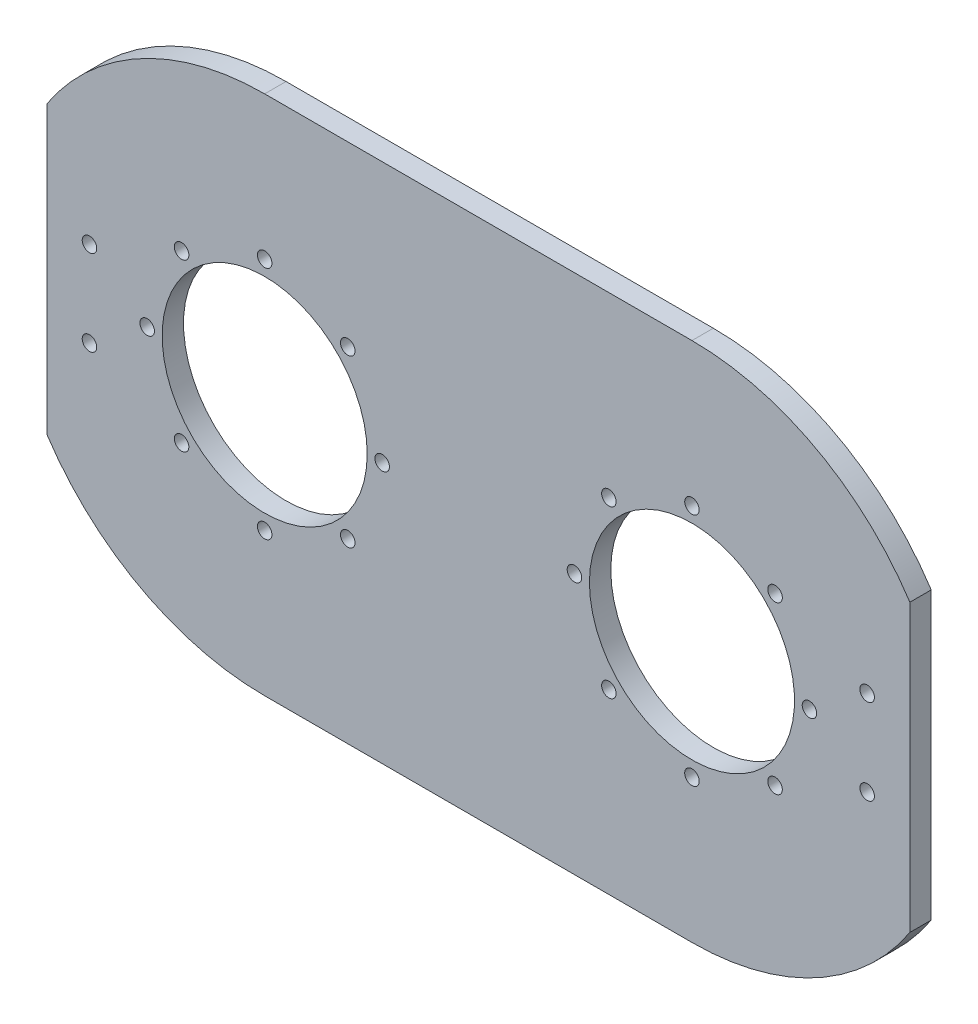
ISO-10303-21;
HEADER;
FILE_DESCRIPTION(('STEP AP214'),'2;1');
FILE_NAME('part.step','',(''),(''),'','','');
FILE_SCHEMA(('AUTOMOTIVE_DESIGN { 1 0 10303 214 1 1 1 1 }'));
ENDSEC;
DATA;
#1=APPLICATION_CONTEXT('core data for automotive mechanical design processes');
#2=APPLICATION_PROTOCOL_DEFINITION('international standard','automotive_design',2000,#1);
#3=PRODUCT_CONTEXT('',#1,'mechanical');
#4=PRODUCT('Part','Part','',(#3));
#5=PRODUCT_RELATED_PRODUCT_CATEGORY('part','',(#4));
#6=PRODUCT_DEFINITION_FORMATION('','',#4);
#7=PRODUCT_DEFINITION_CONTEXT('part definition',#1,'design');
#8=PRODUCT_DEFINITION('design','',#6,#7);
#9=PRODUCT_DEFINITION_SHAPE('','',#8);
#10=(LENGTH_UNIT() NAMED_UNIT(*) SI_UNIT(.MILLI.,.METRE.));
#11=(NAMED_UNIT(*) PLANE_ANGLE_UNIT() SI_UNIT($,.RADIAN.));
#12=(NAMED_UNIT(*) SI_UNIT($,.STERADIAN.) SOLID_ANGLE_UNIT());
#13=UNCERTAINTY_MEASURE_WITH_UNIT(LENGTH_MEASURE(1.E-05),#10,'distance_accuracy_value','');
#14=(GEOMETRIC_REPRESENTATION_CONTEXT(3) GLOBAL_UNCERTAINTY_ASSIGNED_CONTEXT((#13)) GLOBAL_UNIT_ASSIGNED_CONTEXT((#10,
#11,#12)) REPRESENTATION_CONTEXT('',''));
#15=CARTESIAN_POINT('',(0.,0.,0.));
#16=DIRECTION('',(0.,0.,1.));
#17=DIRECTION('',(1.,0.,0.));
#18=AXIS2_PLACEMENT_3D('',#15,#16,#17);
#19=CARTESIAN_POINT('',(50.,0.,5.));
#20=DIRECTION('',(0.,0.,-1.));
#21=DIRECTION('',(-1.,0.,0.));
#22=AXIS2_PLACEMENT_3D('',#19,#20,#21);
#23=CYLINDRICAL_SURFACE('',#22,61.);
#24=DIRECTION('',(0.,0.,1.));
#25=VECTOR('',#24,1.);
#26=CARTESIAN_POINT('',(101.,-33.4664010613631,0.));
#27=LINE('',#26,#25);
#28=CARTESIAN_POINT('',(101.,-33.4664010613631,0.));
#29=VERTEX_POINT('',#28);
#30=CARTESIAN_POINT('',(101.,-33.4664010613631,5.));
#31=VERTEX_POINT('',#30);
#32=EDGE_CURVE('E48',#29,#31,#27,.T.);
#33=ORIENTED_EDGE('',*,*,#32,.T.);
#34=CARTESIAN_POINT('',(50.,0.,5.));
#35=DIRECTION('',(0.,0.,1.));
#36=DIRECTION('',(1.,0.,0.));
#37=AXIS2_PLACEMENT_3D('',#34,#35,#36);
#38=CIRCLE('',#37,61.);
#39=CARTESIAN_POINT('',(50.,-61.,5.));
#40=VERTEX_POINT('',#39);
#41=EDGE_CURVE('E137',#40,#31,#38,.T.);
#42=ORIENTED_EDGE('',*,*,#41,.F.);
#43=DIRECTION('',(0.,0.,-1.));
#44=VECTOR('',#43,1.);
#45=CARTESIAN_POINT('',(50.,-61.,5.));
#46=LINE('',#45,#44);
#47=CARTESIAN_POINT('',(50.,-61.,0.));
#48=VERTEX_POINT('',#47);
#49=EDGE_CURVE('E41',#40,#48,#46,.T.);
#50=ORIENTED_EDGE('',*,*,#49,.T.);
#51=CARTESIAN_POINT('',(50.,0.,0.));
#52=DIRECTION('',(0.,0.,1.));
#53=DIRECTION('',(1.,0.,0.));
#54=AXIS2_PLACEMENT_3D('',#51,#52,#53);
#55=CIRCLE('',#54,61.);
#56=EDGE_CURVE('E118',#48,#29,#55,.T.);
#57=ORIENTED_EDGE('',*,*,#56,.T.);
#58=EDGE_LOOP('',(#33,#42,#50,#57));
#59=FACE_BOUND('',#58,.T.);
#60=ADVANCED_FACE('F33',(#59),#23,.T.);
#61=DIRECTION('',(0.,0.,1.));
#62=VECTOR('',#61,1.);
#63=CARTESIAN_POINT('',(101.,33.4664010613631,0.));
#64=LINE('',#63,#62);
#65=CARTESIAN_POINT('',(101.,33.4664010613631,0.));
#66=VERTEX_POINT('',#65);
#67=CARTESIAN_POINT('',(101.,33.4664010613631,5.));
#68=VERTEX_POINT('',#67);
#69=EDGE_CURVE('E98',#66,#68,#64,.T.);
#70=ORIENTED_EDGE('',*,*,#69,.F.);
#71=CARTESIAN_POINT('',(50.,61.,0.));
#72=VERTEX_POINT('',#71);
#73=EDGE_CURVE('E110',#66,#72,#55,.T.);
#74=ORIENTED_EDGE('',*,*,#73,.T.);
#75=DIRECTION('',(0.,0.,-1.));
#76=VECTOR('',#75,1.);
#77=CARTESIAN_POINT('',(50.,61.,5.));
#78=LINE('',#77,#76);
#79=CARTESIAN_POINT('',(50.,61.,5.));
#80=VERTEX_POINT('',#79);
#81=EDGE_CURVE('E130',#80,#72,#78,.T.);
#82=ORIENTED_EDGE('',*,*,#81,.F.);
#83=EDGE_CURVE('E112',#68,#80,#38,.T.);
#84=ORIENTED_EDGE('',*,*,#83,.F.);
#85=EDGE_LOOP('',(#70,#74,#82,#84));
#86=FACE_BOUND('',#85,.T.);
#87=ADVANCED_FACE('F108',(#86),#23,.T.);
#88=CARTESIAN_POINT('',(-50.,0.,5.));
#89=DIRECTION('',(0.,0.,1.));
#90=DIRECTION('',(1.,0.,0.));
#91=AXIS2_PLACEMENT_3D('',#88,#89,#90);
#92=PLANE('',#91);
#93=CARTESIAN_POINT('',(91.,-10.,5.));
#94=DIRECTION('',(0.,0.,1.));
#95=DIRECTION('',(1.,0.,0.));
#96=AXIS2_PLACEMENT_3D('',#93,#94,#95);
#97=CIRCLE('',#96,1.69999999999999);
#98=CARTESIAN_POINT('',(92.7,-10.,5.));
#99=VERTEX_POINT('',#98);
#100=EDGE_CURVE('E296',#99,#99,#97,.T.);
#101=ORIENTED_EDGE('',*,*,#100,.F.);
#102=EDGE_LOOP('',(#101));
#103=FACE_BOUND('',#102,.T.);
#104=CARTESIAN_POINT('',(91.,10.,5.));
#105=DIRECTION('',(0.,0.,1.));
#106=DIRECTION('',(1.,0.,0.));
#107=AXIS2_PLACEMENT_3D('',#104,#105,#106);
#108=CIRCLE('',#107,1.69999999999999);
#109=CARTESIAN_POINT('',(92.7,10.,5.));
#110=VERTEX_POINT('',#109);
#111=EDGE_CURVE('E290',#110,#110,#108,.T.);
#112=ORIENTED_EDGE('',*,*,#111,.F.);
#113=EDGE_LOOP('',(#112));
#114=FACE_BOUND('',#113,.T.);
#115=CARTESIAN_POINT('',(-91.,-10.,5.));
#116=DIRECTION('',(0.,0.,1.));
#117=DIRECTION('',(1.,0.,0.));
#118=AXIS2_PLACEMENT_3D('',#115,#116,#117);
#119=CIRCLE('',#118,1.69999999999999);
#120=CARTESIAN_POINT('',(-89.3,-10.,5.));
#121=VERTEX_POINT('',#120);
#122=EDGE_CURVE('E282',#121,#121,#119,.T.);
#123=ORIENTED_EDGE('',*,*,#122,.F.);
#124=EDGE_LOOP('',(#123));
#125=FACE_BOUND('',#124,.T.);
#126=CARTESIAN_POINT('',(-91.,10.,5.));
#127=DIRECTION('',(0.,0.,1.));
#128=DIRECTION('',(1.,0.,0.));
#129=AXIS2_PLACEMENT_3D('',#126,#127,#128);
#130=CIRCLE('',#129,1.69999999999999);
#131=CARTESIAN_POINT('',(-89.3,10.,5.));
#132=VERTEX_POINT('',#131);
#133=EDGE_CURVE('E276',#132,#132,#130,.T.);
#134=ORIENTED_EDGE('',*,*,#133,.F.);
#135=EDGE_LOOP('',(#134));
#136=FACE_BOUND('',#135,.T.);
#137=CARTESIAN_POINT('',(69.4454364826301,19.44543648263,5.));
#138=DIRECTION('',(0.,0.,-1.));
#139=DIRECTION('',(-0.707106781186546,0.707106781186549,0.));
#140=AXIS2_PLACEMENT_3D('',#137,#138,#139);
#141=CIRCLE('',#140,1.69999999999999);
#142=CARTESIAN_POINT('',(68.243354954613,20.6475180106472,5.));
#143=VERTEX_POINT('',#142);
#144=EDGE_CURVE('E225',#143,#143,#141,.T.);
#145=ORIENTED_EDGE('',*,*,#144,.T.);
#146=EDGE_LOOP('',(#145));
#147=FACE_BOUND('',#146,.T.);
#148=CARTESIAN_POINT('',(77.5,0.,5.));
#149=DIRECTION('',(0.,0.,-1.));
#150=DIRECTION('',(0.,1.,0.));
#151=AXIS2_PLACEMENT_3D('',#148,#149,#150);
#152=CIRCLE('',#151,1.69999999999999);
#153=CARTESIAN_POINT('',(77.5,1.69999999999989,5.));
#154=VERTEX_POINT('',#153);
#155=EDGE_CURVE('E257',#154,#154,#152,.T.);
#156=ORIENTED_EDGE('',*,*,#155,.T.);
#157=EDGE_LOOP('',(#156));
#158=FACE_BOUND('',#157,.T.);
#159=CARTESIAN_POINT('',(69.44543648263,-19.4454364826302,5.));
#160=DIRECTION('',(0.,0.,-1.));
#161=DIRECTION('',(0.707106781186551,0.707106781186544,0.));
#162=AXIS2_PLACEMENT_3D('',#159,#160,#161);
#163=CIRCLE('',#162,1.69999999999999);
#164=CARTESIAN_POINT('',(70.6475180106471,-18.243354954613,5.));
#165=VERTEX_POINT('',#164);
#166=EDGE_CURVE('E251',#165,#165,#163,.T.);
#167=ORIENTED_EDGE('',*,*,#166,.T.);
#168=EDGE_LOOP('',(#167));
#169=FACE_BOUND('',#168,.T.);
#170=CARTESIAN_POINT('',(50.,-27.5,5.));
#171=DIRECTION('',(0.,0.,-1.));
#172=DIRECTION('',(1.,0.,0.));
#173=AXIS2_PLACEMENT_3D('',#170,#171,#172);
#174=CIRCLE('',#173,1.69999999999999);
#175=CARTESIAN_POINT('',(51.7,-27.5,5.));
#176=VERTEX_POINT('',#175);
#177=EDGE_CURVE('E245',#176,#176,#174,.T.);
#178=ORIENTED_EDGE('',*,*,#177,.T.);
#179=EDGE_LOOP('',(#178));
#180=FACE_BOUND('',#179,.T.);
#181=CARTESIAN_POINT('',(30.5545635173698,-19.4454364826299,5.));
#182=DIRECTION('',(0.,0.,-1.));
#183=DIRECTION('',(0.707106781186541,-0.707106781186554,0.));
#184=AXIS2_PLACEMENT_3D('',#181,#182,#183);
#185=CIRCLE('',#184,1.69999999999999);
#186=CARTESIAN_POINT('',(31.7566450453869,-20.647518010647,5.));
#187=VERTEX_POINT('',#186);
#188=EDGE_CURVE('E239',#187,#187,#185,.T.);
#189=ORIENTED_EDGE('',*,*,#188,.T.);
#190=EDGE_LOOP('',(#189));
#191=FACE_BOUND('',#190,.T.);
#192=CARTESIAN_POINT('',(22.5,2.91433543964104E-13,5.));
#193=DIRECTION('',(0.,0.,-1.));
#194=DIRECTION('',(0.,-1.,0.));
#195=AXIS2_PLACEMENT_3D('',#192,#193,#194);
#196=CIRCLE('',#195,1.69999999999999);
#197=CARTESIAN_POINT('',(22.5,-1.69999999999969,5.));
#198=VERTEX_POINT('',#197);
#199=EDGE_CURVE('E233',#198,#198,#196,.T.);
#200=ORIENTED_EDGE('',*,*,#199,.T.);
#201=EDGE_LOOP('',(#200));
#202=FACE_BOUND('',#201,.T.);
#203=CARTESIAN_POINT('',(30.5545635173702,19.4454364826303,5.));
#204=DIRECTION('',(0.,0.,-1.));
#205=DIRECTION('',(-0.707106781186556,-0.707106781186539,0.));
#206=AXIS2_PLACEMENT_3D('',#203,#204,#205);
#207=CIRCLE('',#206,1.69999999999999);
#208=CARTESIAN_POINT('',(29.352481989353,18.2433549546132,5.));
#209=VERTEX_POINT('',#208);
#210=EDGE_CURVE('E226',#209,#209,#207,.T.);
#211=ORIENTED_EDGE('',*,*,#210,.T.);
#212=EDGE_LOOP('',(#211));
#213=FACE_BOUND('',#212,.T.);
#214=CARTESIAN_POINT('',(50.,27.5,5.));
#215=DIRECTION('',(0.,0.,1.));
#216=DIRECTION('',(1.,0.,0.));
#217=AXIS2_PLACEMENT_3D('',#214,#215,#216);
#218=CIRCLE('',#217,1.69999999999999);
#219=CARTESIAN_POINT('',(51.7,27.5,5.));
#220=VERTEX_POINT('',#219);
#221=EDGE_CURVE('E222',#220,#220,#218,.T.);
#222=ORIENTED_EDGE('',*,*,#221,.F.);
#223=EDGE_LOOP('',(#222));
#224=FACE_BOUND('',#223,.T.);
#225=CARTESIAN_POINT('',(50.,0.,5.));
#226=DIRECTION('',(0.,0.,-1.));
#227=DIRECTION('',(-1.,0.,0.));
#228=AXIS2_PLACEMENT_3D('',#225,#226,#227);
#229=CIRCLE('',#228,24.);
#230=CARTESIAN_POINT('',(26.,0.,5.));
#231=VERTEX_POINT('',#230);
#232=EDGE_CURVE('E214',#231,#231,#229,.T.);
#233=ORIENTED_EDGE('',*,*,#232,.T.);
#234=EDGE_LOOP('',(#233));
#235=FACE_BOUND('',#234,.T.);
#236=CARTESIAN_POINT('',(-77.5,0.,5.));
#237=DIRECTION('',(0.,0.,1.));
#238=DIRECTION('',(0.,1.,0.));
#239=AXIS2_PLACEMENT_3D('',#236,#237,#238);
#240=CIRCLE('',#239,1.69999999999999);
#241=CARTESIAN_POINT('',(-77.5,1.69999999999989,5.));
#242=VERTEX_POINT('',#241);
#243=EDGE_CURVE('E177',#242,#242,#240,.T.);
#244=ORIENTED_EDGE('',*,*,#243,.F.);
#245=EDGE_LOOP('',(#244));
#246=FACE_BOUND('',#245,.T.);
#247=CARTESIAN_POINT('',(-69.44543648263,-19.4454364826302,5.));
#248=DIRECTION('',(0.,0.,1.));
#249=DIRECTION('',(-0.707106781186551,0.707106781186544,0.));
#250=AXIS2_PLACEMENT_3D('',#247,#248,#249);
#251=CIRCLE('',#250,1.69999999999999);
#252=CARTESIAN_POINT('',(-70.6475180106471,-18.243354954613,5.));
#253=VERTEX_POINT('',#252);
#254=EDGE_CURVE('E192',#253,#253,#251,.T.);
#255=ORIENTED_EDGE('',*,*,#254,.F.);
#256=EDGE_LOOP('',(#255));
#257=FACE_BOUND('',#256,.T.);
#258=CARTESIAN_POINT('',(-50.,-27.5,5.));
#259=DIRECTION('',(0.,0.,1.));
#260=DIRECTION('',(-1.,0.,0.));
#261=AXIS2_PLACEMENT_3D('',#258,#259,#260);
#262=CIRCLE('',#261,1.69999999999999);
#263=CARTESIAN_POINT('',(-51.7,-27.5,5.));
#264=VERTEX_POINT('',#263);
#265=EDGE_CURVE('E186',#264,#264,#262,.T.);
#266=ORIENTED_EDGE('',*,*,#265,.F.);
#267=EDGE_LOOP('',(#266));
#268=FACE_BOUND('',#267,.T.);
#269=CARTESIAN_POINT('',(-30.5545635173698,-19.4454364826299,5.));
#270=DIRECTION('',(0.,0.,1.));
#271=DIRECTION('',(-0.707106781186541,-0.707106781186554,0.));
#272=AXIS2_PLACEMENT_3D('',#269,#270,#271);
#273=CIRCLE('',#272,1.69999999999999);
#274=CARTESIAN_POINT('',(-31.7566450453869,-20.647518010647,5.));
#275=VERTEX_POINT('',#274);
#276=EDGE_CURVE('E178',#275,#275,#273,.T.);
#277=ORIENTED_EDGE('',*,*,#276,.F.);
#278=EDGE_LOOP('',(#277));
#279=FACE_BOUND('',#278,.T.);
#280=CARTESIAN_POINT('',(-22.5,2.91433543964104E-13,5.));
#281=DIRECTION('',(0.,0.,1.));
#282=DIRECTION('',(0.,-1.,0.));
#283=AXIS2_PLACEMENT_3D('',#280,#281,#282);
#284=CIRCLE('',#283,1.69999999999999);
#285=CARTESIAN_POINT('',(-22.5,-1.69999999999969,5.));
#286=VERTEX_POINT('',#285);
#287=EDGE_CURVE('E185',#286,#286,#284,.T.);
#288=ORIENTED_EDGE('',*,*,#287,.F.);
#289=EDGE_LOOP('',(#288));
#290=FACE_BOUND('',#289,.T.);
#291=CARTESIAN_POINT('',(-30.5545635173702,19.4454364826303,5.));
#292=DIRECTION('',(0.,0.,1.));
#293=DIRECTION('',(0.707106781186556,-0.707106781186539,0.));
#294=AXIS2_PLACEMENT_3D('',#291,#292,#293);
#295=CIRCLE('',#294,1.69999999999999);
#296=CARTESIAN_POINT('',(-29.352481989353,18.2433549546132,5.));
#297=VERTEX_POINT('',#296);
#298=EDGE_CURVE('E202',#297,#297,#295,.T.);
#299=ORIENTED_EDGE('',*,*,#298,.F.);
#300=EDGE_LOOP('',(#299));
#301=FACE_BOUND('',#300,.T.);
#302=CARTESIAN_POINT('',(-69.4454364826301,19.44543648263,5.));
#303=DIRECTION('',(0.,0.,1.));
#304=DIRECTION('',(0.707106781186546,0.707106781186549,0.));
#305=AXIS2_PLACEMENT_3D('',#302,#303,#304);
#306=CIRCLE('',#305,1.69999999999999);
#307=CARTESIAN_POINT('',(-68.243354954613,20.6475180106472,5.));
#308=VERTEX_POINT('',#307);
#309=EDGE_CURVE('E171',#308,#308,#306,.T.);
#310=ORIENTED_EDGE('',*,*,#309,.F.);
#311=EDGE_LOOP('',(#310));
#312=FACE_BOUND('',#311,.T.);
#313=CARTESIAN_POINT('',(-50.,27.5,5.));
#314=DIRECTION('',(0.,0.,1.));
#315=DIRECTION('',(1.,0.,0.));
#316=AXIS2_PLACEMENT_3D('',#313,#314,#315);
#317=CIRCLE('',#316,1.69999999999999);
#318=CARTESIAN_POINT('',(-48.3,27.5,5.));
#319=VERTEX_POINT('',#318);
#320=EDGE_CURVE('E168',#319,#319,#317,.T.);
#321=ORIENTED_EDGE('',*,*,#320,.F.);
#322=EDGE_LOOP('',(#321));
#323=FACE_BOUND('',#322,.T.);
#324=CARTESIAN_POINT('',(-50.,0.,5.));
#325=DIRECTION('',(0.,0.,1.));
#326=DIRECTION('',(1.,0.,0.));
#327=AXIS2_PLACEMENT_3D('',#324,#325,#326);
#328=CIRCLE('',#327,24.);
#329=CARTESIAN_POINT('',(-26.,0.,5.));
#330=VERTEX_POINT('',#329);
#331=EDGE_CURVE('E154',#330,#330,#328,.T.);
#332=ORIENTED_EDGE('',*,*,#331,.F.);
#333=EDGE_LOOP('',(#332));
#334=FACE_BOUND('',#333,.T.);
#335=ORIENTED_EDGE('',*,*,#41,.T.);
#336=DIRECTION('',(0.,1.,0.));
#337=VECTOR('',#336,1.);
#338=CARTESIAN_POINT('',(101.,33.4664010613631,5.));
#339=LINE('',#338,#337);
#340=EDGE_CURVE('E104',#31,#68,#339,.T.);
#341=ORIENTED_EDGE('',*,*,#340,.T.);
#342=ORIENTED_EDGE('',*,*,#83,.T.);
#343=DIRECTION('',(-1.,0.,0.));
#344=VECTOR('',#343,1.);
#345=CARTESIAN_POINT('',(-50.,61.,5.));
#346=LINE('',#345,#344);
#347=CARTESIAN_POINT('',(-50.,61.,5.));
#348=VERTEX_POINT('',#347);
#349=EDGE_CURVE('E131',#80,#348,#346,.T.);
#350=ORIENTED_EDGE('',*,*,#349,.T.);
#351=CARTESIAN_POINT('',(-50.,0.,5.));
#352=DIRECTION('',(0.,0.,1.));
#353=DIRECTION('',(1.,0.,0.));
#354=AXIS2_PLACEMENT_3D('',#351,#352,#353);
#355=CIRCLE('',#354,61.);
#356=CARTESIAN_POINT('',(-101.,33.4664010613631,5.));
#357=VERTEX_POINT('',#356);
#358=EDGE_CURVE('E160',#348,#357,#355,.T.);
#359=ORIENTED_EDGE('',*,*,#358,.T.);
#360=DIRECTION('',(0.,1.,0.));
#361=VECTOR('',#360,1.);
#362=CARTESIAN_POINT('',(-101.,33.4664010613631,5.));
#363=LINE('',#362,#361);
#364=CARTESIAN_POINT('',(-101.,-33.4664010613631,5.));
#365=VERTEX_POINT('',#364);
#366=EDGE_CURVE('E270',#365,#357,#363,.T.);
#367=ORIENTED_EDGE('',*,*,#366,.F.);
#368=CARTESIAN_POINT('',(-50.,-61.,5.));
#369=VERTEX_POINT('',#368);
#370=EDGE_CURVE('E126',#365,#369,#355,.T.);
#371=ORIENTED_EDGE('',*,*,#370,.T.);
#372=DIRECTION('',(1.,0.,0.));
#373=VECTOR('',#372,1.);
#374=CARTESIAN_POINT('',(-50.,-61.,5.));
#375=LINE('',#374,#373);
#376=EDGE_CURVE('E145',#369,#40,#375,.T.);
#377=ORIENTED_EDGE('',*,*,#376,.T.);
#378=EDGE_LOOP('',(#335,#341,#342,#350,#359,#367,#371,#377));
#379=FACE_BOUND('',#378,.T.);
#380=ADVANCED_FACE('F302',(#103,#114,#125,#136,#147,#158,#169,#180,#191,#202,#213,#224,#235,
#246,#257,#268,#279,#290,#301,#312,#323,#334,#379),#92,.T.);
#381=CARTESIAN_POINT('',(-50.,0.,0.));
#382=DIRECTION('',(0.,0.,1.));
#383=DIRECTION('',(1.,0.,0.));
#384=AXIS2_PLACEMENT_3D('',#381,#382,#383);
#385=PLANE('',#384);
#386=CARTESIAN_POINT('',(91.,-10.,0.));
#387=DIRECTION('',(0.,0.,1.));
#388=DIRECTION('',(1.,0.,0.));
#389=AXIS2_PLACEMENT_3D('',#386,#387,#388);
#390=CIRCLE('',#389,1.69999999999999);
#391=CARTESIAN_POINT('',(92.7,-10.,0.));
#392=VERTEX_POINT('',#391);
#393=EDGE_CURVE('E293',#392,#392,#390,.T.);
#394=ORIENTED_EDGE('',*,*,#393,.T.);
#395=EDGE_LOOP('',(#394));
#396=FACE_BOUND('',#395,.T.);
#397=CARTESIAN_POINT('',(91.,10.,0.));
#398=DIRECTION('',(0.,0.,1.));
#399=DIRECTION('',(1.,0.,0.));
#400=AXIS2_PLACEMENT_3D('',#397,#398,#399);
#401=CIRCLE('',#400,1.69999999999999);
#402=CARTESIAN_POINT('',(92.7,10.,0.));
#403=VERTEX_POINT('',#402);
#404=EDGE_CURVE('E286',#403,#403,#401,.T.);
#405=ORIENTED_EDGE('',*,*,#404,.T.);
#406=EDGE_LOOP('',(#405));
#407=FACE_BOUND('',#406,.T.);
#408=CARTESIAN_POINT('',(-50.,0.,0.));
#409=DIRECTION('',(0.,0.,1.));
#410=DIRECTION('',(1.,0.,0.));
#411=AXIS2_PLACEMENT_3D('',#408,#409,#410);
#412=CIRCLE('',#411,24.);
#413=CARTESIAN_POINT('',(-26.,0.,0.));
#414=VERTEX_POINT('',#413);
#415=EDGE_CURVE('E151',#414,#414,#412,.T.);
#416=ORIENTED_EDGE('',*,*,#415,.T.);
#417=EDGE_LOOP('',(#416));
#418=FACE_BOUND('',#417,.T.);
#419=CARTESIAN_POINT('',(-50.,27.5,0.));
#420=DIRECTION('',(0.,0.,1.));
#421=DIRECTION('',(1.,0.,0.));
#422=AXIS2_PLACEMENT_3D('',#419,#420,#421);
#423=CIRCLE('',#422,1.7);
#424=CARTESIAN_POINT('',(-48.3,27.5,0.));
#425=VERTEX_POINT('',#424);
#426=EDGE_CURVE('E164',#425,#425,#423,.T.);
#427=ORIENTED_EDGE('',*,*,#426,.T.);
#428=EDGE_LOOP('',(#427));
#429=FACE_BOUND('',#428,.T.);
#430=CARTESIAN_POINT('',(-69.4454364826301,19.44543648263,0.));
#431=DIRECTION('',(0.,0.,1.));
#432=DIRECTION('',(0.707106781186546,0.707106781186549,0.));
#433=AXIS2_PLACEMENT_3D('',#430,#431,#432);
#434=CIRCLE('',#433,1.7);
#435=CARTESIAN_POINT('',(-68.243354954613,20.6475180106472,0.));
#436=VERTEX_POINT('',#435);
#437=EDGE_CURVE('E174',#436,#436,#434,.T.);
#438=ORIENTED_EDGE('',*,*,#437,.T.);
#439=EDGE_LOOP('',(#438));
#440=FACE_BOUND('',#439,.T.);
#441=CARTESIAN_POINT('',(-30.5545635173702,19.4454364826303,0.));
#442=DIRECTION('',(0.,0.,1.));
#443=DIRECTION('',(0.707106781186556,-0.707106781186539,0.));
#444=AXIS2_PLACEMENT_3D('',#441,#442,#443);
#445=CIRCLE('',#444,1.7);
#446=CARTESIAN_POINT('',(-29.352481989353,18.2433549546132,0.));
#447=VERTEX_POINT('',#446);
#448=EDGE_CURVE('E206',#447,#447,#445,.T.);
#449=ORIENTED_EDGE('',*,*,#448,.T.);
#450=EDGE_LOOP('',(#449));
#451=FACE_BOUND('',#450,.T.);
#452=CARTESIAN_POINT('',(-22.5,2.91433543964104E-13,0.));
#453=DIRECTION('',(0.,0.,1.));
#454=DIRECTION('',(0.,-1.,0.));
#455=AXIS2_PLACEMENT_3D('',#452,#453,#454);
#456=CIRCLE('',#455,1.7);
#457=CARTESIAN_POINT('',(-22.5,-1.69999999999971,0.));
#458=VERTEX_POINT('',#457);
#459=EDGE_CURVE('E205',#458,#458,#456,.T.);
#460=ORIENTED_EDGE('',*,*,#459,.T.);
#461=EDGE_LOOP('',(#460));
#462=FACE_BOUND('',#461,.T.);
#463=CARTESIAN_POINT('',(-30.5545635173698,-19.4454364826299,0.));
#464=DIRECTION('',(0.,0.,1.));
#465=DIRECTION('',(-0.707106781186541,-0.707106781186554,0.));
#466=AXIS2_PLACEMENT_3D('',#463,#464,#465);
#467=CIRCLE('',#466,1.7);
#468=CARTESIAN_POINT('',(-31.7566450453869,-20.647518010647,0.));
#469=VERTEX_POINT('',#468);
#470=EDGE_CURVE('E182',#469,#469,#467,.T.);
#471=ORIENTED_EDGE('',*,*,#470,.T.);
#472=EDGE_LOOP('',(#471));
#473=FACE_BOUND('',#472,.T.);
#474=CARTESIAN_POINT('',(-50.,-27.5,0.));
#475=DIRECTION('',(0.,0.,1.));
#476=DIRECTION('',(-1.,0.,0.));
#477=AXIS2_PLACEMENT_3D('',#474,#475,#476);
#478=CIRCLE('',#477,1.7);
#479=CARTESIAN_POINT('',(-51.7,-27.5,0.));
#480=VERTEX_POINT('',#479);
#481=EDGE_CURVE('E181',#480,#480,#478,.T.);
#482=ORIENTED_EDGE('',*,*,#481,.T.);
#483=EDGE_LOOP('',(#482));
#484=FACE_BOUND('',#483,.T.);
#485=CARTESIAN_POINT('',(-69.44543648263,-19.4454364826302,0.));
#486=DIRECTION('',(0.,0.,1.));
#487=DIRECTION('',(-0.707106781186551,0.707106781186544,0.));
#488=AXIS2_PLACEMENT_3D('',#485,#486,#487);
#489=CIRCLE('',#488,1.7);
#490=CARTESIAN_POINT('',(-70.6475180106471,-18.243354954613,0.));
#491=VERTEX_POINT('',#490);
#492=EDGE_CURVE('E189',#491,#491,#489,.T.);
#493=ORIENTED_EDGE('',*,*,#492,.T.);
#494=EDGE_LOOP('',(#493));
#495=FACE_BOUND('',#494,.T.);
#496=CARTESIAN_POINT('',(-77.5,0.,0.));
#497=DIRECTION('',(0.,0.,1.));
#498=DIRECTION('',(0.,1.,0.));
#499=AXIS2_PLACEMENT_3D('',#496,#497,#498);
#500=CIRCLE('',#499,1.7);
#501=CARTESIAN_POINT('',(-77.5,1.6999999999999,0.));
#502=VERTEX_POINT('',#501);
#503=EDGE_CURVE('E195',#502,#502,#500,.T.);
#504=ORIENTED_EDGE('',*,*,#503,.T.);
#505=EDGE_LOOP('',(#504));
#506=FACE_BOUND('',#505,.T.);
#507=CARTESIAN_POINT('',(50.,0.,0.));
#508=DIRECTION('',(0.,0.,-1.));
#509=DIRECTION('',(-1.,0.,0.));
#510=AXIS2_PLACEMENT_3D('',#507,#508,#509);
#511=CIRCLE('',#510,24.);
#512=CARTESIAN_POINT('',(26.,0.,0.));
#513=VERTEX_POINT('',#512);
#514=EDGE_CURVE('E209',#513,#513,#511,.T.);
#515=ORIENTED_EDGE('',*,*,#514,.F.);
#516=EDGE_LOOP('',(#515));
#517=FACE_BOUND('',#516,.T.);
#518=CARTESIAN_POINT('',(50.,27.5,0.));
#519=DIRECTION('',(0.,0.,1.));
#520=DIRECTION('',(1.,0.,0.));
#521=AXIS2_PLACEMENT_3D('',#518,#519,#520);
#522=CIRCLE('',#521,1.7);
#523=CARTESIAN_POINT('',(51.7,27.5,0.));
#524=VERTEX_POINT('',#523);
#525=EDGE_CURVE('E217',#524,#524,#522,.T.);
#526=ORIENTED_EDGE('',*,*,#525,.T.);
#527=EDGE_LOOP('',(#526));
#528=FACE_BOUND('',#527,.T.);
#529=CARTESIAN_POINT('',(30.5545635173702,19.4454364826303,0.));
#530=DIRECTION('',(0.,0.,-1.));
#531=DIRECTION('',(-0.707106781186556,-0.707106781186539,0.));
#532=AXIS2_PLACEMENT_3D('',#529,#530,#531);
#533=CIRCLE('',#532,1.7);
#534=CARTESIAN_POINT('',(29.352481989353,18.2433549546132,0.));
#535=VERTEX_POINT('',#534);
#536=EDGE_CURVE('E230',#535,#535,#533,.T.);
#537=ORIENTED_EDGE('',*,*,#536,.F.);
#538=EDGE_LOOP('',(#537));
#539=FACE_BOUND('',#538,.T.);
#540=CARTESIAN_POINT('',(22.5,2.91433543964104E-13,0.));
#541=DIRECTION('',(0.,0.,-1.));
#542=DIRECTION('',(0.,-1.,0.));
#543=AXIS2_PLACEMENT_3D('',#540,#541,#542);
#544=CIRCLE('',#543,1.7);
#545=CARTESIAN_POINT('',(22.5,-1.69999999999971,0.));
#546=VERTEX_POINT('',#545);
#547=EDGE_CURVE('E229',#546,#546,#544,.T.);
#548=ORIENTED_EDGE('',*,*,#547,.F.);
#549=EDGE_LOOP('',(#548));
#550=FACE_BOUND('',#549,.T.);
#551=CARTESIAN_POINT('',(30.5545635173698,-19.4454364826299,0.));
#552=DIRECTION('',(0.,0.,-1.));
#553=DIRECTION('',(0.707106781186541,-0.707106781186554,0.));
#554=AXIS2_PLACEMENT_3D('',#551,#552,#553);
#555=CIRCLE('',#554,1.7);
#556=CARTESIAN_POINT('',(31.7566450453869,-20.647518010647,0.));
#557=VERTEX_POINT('',#556);
#558=EDGE_CURVE('E236',#557,#557,#555,.T.);
#559=ORIENTED_EDGE('',*,*,#558,.F.);
#560=EDGE_LOOP('',(#559));
#561=FACE_BOUND('',#560,.T.);
#562=CARTESIAN_POINT('',(50.,-27.5,0.));
#563=DIRECTION('',(0.,0.,-1.));
#564=DIRECTION('',(1.,0.,0.));
#565=AXIS2_PLACEMENT_3D('',#562,#563,#564);
#566=CIRCLE('',#565,1.7);
#567=CARTESIAN_POINT('',(51.7,-27.5,0.));
#568=VERTEX_POINT('',#567);
#569=EDGE_CURVE('E242',#568,#568,#566,.T.);
#570=ORIENTED_EDGE('',*,*,#569,.F.);
#571=EDGE_LOOP('',(#570));
#572=FACE_BOUND('',#571,.T.);
#573=CARTESIAN_POINT('',(69.44543648263,-19.4454364826302,0.));
#574=DIRECTION('',(0.,0.,-1.));
#575=DIRECTION('',(0.707106781186551,0.707106781186544,0.));
#576=AXIS2_PLACEMENT_3D('',#573,#574,#575);
#577=CIRCLE('',#576,1.7);
#578=CARTESIAN_POINT('',(70.6475180106471,-18.243354954613,0.));
#579=VERTEX_POINT('',#578);
#580=EDGE_CURVE('E248',#579,#579,#577,.T.);
#581=ORIENTED_EDGE('',*,*,#580,.F.);
#582=EDGE_LOOP('',(#581));
#583=FACE_BOUND('',#582,.T.);
#584=CARTESIAN_POINT('',(77.5,0.,0.));
#585=DIRECTION('',(0.,0.,-1.));
#586=DIRECTION('',(0.,1.,0.));
#587=AXIS2_PLACEMENT_3D('',#584,#585,#586);
#588=CIRCLE('',#587,1.7);
#589=CARTESIAN_POINT('',(77.5,1.6999999999999,0.));
#590=VERTEX_POINT('',#589);
#591=EDGE_CURVE('E254',#590,#590,#588,.T.);
#592=ORIENTED_EDGE('',*,*,#591,.F.);
#593=EDGE_LOOP('',(#592));
#594=FACE_BOUND('',#593,.T.);
#595=CARTESIAN_POINT('',(69.4454364826301,19.44543648263,0.));
#596=DIRECTION('',(0.,0.,-1.));
#597=DIRECTION('',(-0.707106781186546,0.707106781186549,0.));
#598=AXIS2_PLACEMENT_3D('',#595,#596,#597);
#599=CIRCLE('',#598,1.7);
#600=CARTESIAN_POINT('',(68.243354954613,20.6475180106472,0.));
#601=VERTEX_POINT('',#600);
#602=EDGE_CURVE('E260',#601,#601,#599,.T.);
#603=ORIENTED_EDGE('',*,*,#602,.F.);
#604=EDGE_LOOP('',(#603));
#605=FACE_BOUND('',#604,.T.);
#606=CARTESIAN_POINT('',(-91.,10.,0.));
#607=DIRECTION('',(0.,0.,1.));
#608=DIRECTION('',(1.,0.,0.));
#609=AXIS2_PLACEMENT_3D('',#606,#607,#608);
#610=CIRCLE('',#609,1.69999999999999);
#611=CARTESIAN_POINT('',(-89.3,10.,0.));
#612=VERTEX_POINT('',#611);
#613=EDGE_CURVE('E272',#612,#612,#610,.T.);
#614=ORIENTED_EDGE('',*,*,#613,.T.);
#615=EDGE_LOOP('',(#614));
#616=FACE_BOUND('',#615,.T.);
#617=CARTESIAN_POINT('',(-91.,-10.,0.));
#618=DIRECTION('',(0.,0.,1.));
#619=DIRECTION('',(1.,0.,0.));
#620=AXIS2_PLACEMENT_3D('',#617,#618,#619);
#621=CIRCLE('',#620,1.69999999999999);
#622=CARTESIAN_POINT('',(-89.3,-10.,0.));
#623=VERTEX_POINT('',#622);
#624=EDGE_CURVE('E279',#623,#623,#621,.T.);
#625=ORIENTED_EDGE('',*,*,#624,.T.);
#626=EDGE_LOOP('',(#625));
#627=FACE_BOUND('',#626,.T.);
#628=DIRECTION('',(0.,1.,0.));
#629=VECTOR('',#628,1.);
#630=CARTESIAN_POINT('',(101.,33.4664010613631,0.));
#631=LINE('',#630,#629);
#632=EDGE_CURVE('E95',#29,#66,#631,.T.);
#633=ORIENTED_EDGE('',*,*,#632,.F.);
#634=ORIENTED_EDGE('',*,*,#56,.F.);
#635=DIRECTION('',(1.,0.,0.));
#636=VECTOR('',#635,1.);
#637=CARTESIAN_POINT('',(-50.,-61.,0.));
#638=LINE('',#637,#636);
#639=CARTESIAN_POINT('',(-50.,-61.,0.));
#640=VERTEX_POINT('',#639);
#641=EDGE_CURVE('E119',#640,#48,#638,.T.);
#642=ORIENTED_EDGE('',*,*,#641,.F.);
#643=CARTESIAN_POINT('',(-50.,0.,0.));
#644=DIRECTION('',(0.,0.,1.));
#645=DIRECTION('',(1.,0.,0.));
#646=AXIS2_PLACEMENT_3D('',#643,#644,#645);
#647=CIRCLE('',#646,61.);
#648=CARTESIAN_POINT('',(-101.,-33.4664010613631,0.));
#649=VERTEX_POINT('',#648);
#650=EDGE_CURVE('E142',#649,#640,#647,.T.);
#651=ORIENTED_EDGE('',*,*,#650,.F.);
#652=DIRECTION('',(0.,1.,0.));
#653=VECTOR('',#652,1.);
#654=CARTESIAN_POINT('',(-101.,33.4664010613631,0.));
#655=LINE('',#654,#653);
#656=CARTESIAN_POINT('',(-101.,33.4664010613631,0.));
#657=VERTEX_POINT('',#656);
#658=EDGE_CURVE('E268',#649,#657,#655,.T.);
#659=ORIENTED_EDGE('',*,*,#658,.T.);
#660=CARTESIAN_POINT('',(-50.,61.,0.));
#661=VERTEX_POINT('',#660);
#662=EDGE_CURVE('E121',#661,#657,#647,.T.);
#663=ORIENTED_EDGE('',*,*,#662,.F.);
#664=DIRECTION('',(-1.,0.,0.));
#665=VECTOR('',#664,1.);
#666=CARTESIAN_POINT('',(-50.,61.,0.));
#667=LINE('',#666,#665);
#668=EDGE_CURVE('E117',#72,#661,#667,.T.);
#669=ORIENTED_EDGE('',*,*,#668,.F.);
#670=ORIENTED_EDGE('',*,*,#73,.F.);
#671=EDGE_LOOP('',(#633,#634,#642,#651,#659,#663,#669,#670));
#672=FACE_BOUND('',#671,.T.);
#673=ADVANCED_FACE('F115',(#396,#407,#418,#429,#440,#451,#462,#473,#484,#495,#506,#517,#528,
#539,#550,#561,#572,#583,#594,#605,#616,#627,#672),#385,.F.);
#674=CARTESIAN_POINT('',(-50.,0.,5.));
#675=DIRECTION('',(0.,0.,-1.));
#676=DIRECTION('',(-1.,0.,0.));
#677=AXIS2_PLACEMENT_3D('',#674,#675,#676);
#678=CYLINDRICAL_SURFACE('',#677,61.);
#679=ORIENTED_EDGE('',*,*,#370,.F.);
#680=DIRECTION('',(0.,0.,1.));
#681=VECTOR('',#680,1.);
#682=CARTESIAN_POINT('',(-101.,-33.4664010613631,0.));
#683=LINE('',#682,#681);
#684=EDGE_CURVE('E150',#649,#365,#683,.T.);
#685=ORIENTED_EDGE('',*,*,#684,.F.);
#686=ORIENTED_EDGE('',*,*,#650,.T.);
#687=DIRECTION('',(0.,0.,-1.));
#688=VECTOR('',#687,1.);
#689=CARTESIAN_POINT('',(-50.,-61.,5.));
#690=LINE('',#689,#688);
#691=EDGE_CURVE('E11',#369,#640,#690,.T.);
#692=ORIENTED_EDGE('',*,*,#691,.F.);
#693=EDGE_LOOP('',(#679,#685,#686,#692));
#694=FACE_BOUND('',#693,.T.);
#695=ADVANCED_FACE('F148',(#694),#678,.T.);
#696=ORIENTED_EDGE('',*,*,#662,.T.);
#697=DIRECTION('',(0.,0.,1.));
#698=VECTOR('',#697,1.);
#699=CARTESIAN_POINT('',(-101.,33.4664010613631,0.));
#700=LINE('',#699,#698);
#701=EDGE_CURVE('E56',#657,#357,#700,.T.);
#702=ORIENTED_EDGE('',*,*,#701,.T.);
#703=ORIENTED_EDGE('',*,*,#358,.F.);
#704=DIRECTION('',(0.,0.,-1.));
#705=VECTOR('',#704,1.);
#706=CARTESIAN_POINT('',(-50.,61.,5.));
#707=LINE('',#706,#705);
#708=EDGE_CURVE('E127',#348,#661,#707,.T.);
#709=ORIENTED_EDGE('',*,*,#708,.T.);
#710=EDGE_LOOP('',(#696,#702,#703,#709));
#711=FACE_BOUND('',#710,.T.);
#712=ADVANCED_FACE('F35',(#711),#678,.T.);
#713=CARTESIAN_POINT('',(-50.,-61.,5.));
#714=DIRECTION('',(0.,1.,0.));
#715=DIRECTION('',(-1.,0.,0.));
#716=AXIS2_PLACEMENT_3D('',#713,#714,#715);
#717=PLANE('',#716);
#718=ORIENTED_EDGE('',*,*,#641,.T.);
#719=ORIENTED_EDGE('',*,*,#49,.F.);
#720=ORIENTED_EDGE('',*,*,#376,.F.);
#721=ORIENTED_EDGE('',*,*,#691,.T.);
#722=EDGE_LOOP('',(#718,#719,#720,#721));
#723=FACE_BOUND('',#722,.T.);
#724=ADVANCED_FACE('F144',(#723),#717,.F.);
#725=CARTESIAN_POINT('',(-50.,61.,5.));
#726=DIRECTION('',(0.,-1.,0.));
#727=DIRECTION('',(1.,0.,0.));
#728=AXIS2_PLACEMENT_3D('',#725,#726,#727);
#729=PLANE('',#728);
#730=ORIENTED_EDGE('',*,*,#668,.T.);
#731=ORIENTED_EDGE('',*,*,#708,.F.);
#732=ORIENTED_EDGE('',*,*,#349,.F.);
#733=ORIENTED_EDGE('',*,*,#81,.T.);
#734=EDGE_LOOP('',(#730,#731,#732,#733));
#735=FACE_BOUND('',#734,.T.);
#736=ADVANCED_FACE('F355',(#735),#729,.F.);
#737=CARTESIAN_POINT('',(-50.,0.,0.));
#738=DIRECTION('',(0.,0.,1.));
#739=DIRECTION('',(1.,0.,0.));
#740=AXIS2_PLACEMENT_3D('',#737,#738,#739);
#741=CYLINDRICAL_SURFACE('',#740,24.);
#742=ORIENTED_EDGE('',*,*,#415,.F.);
#743=EDGE_LOOP('',(#742));
#744=FACE_BOUND('',#743,.T.);
#745=ORIENTED_EDGE('',*,*,#331,.T.);
#746=EDGE_LOOP('',(#745));
#747=FACE_BOUND('',#746,.T.);
#748=ADVANCED_FACE('F357',(#744,#747),#741,.F.);
#749=CARTESIAN_POINT('',(-50.,27.5,5.));
#750=DIRECTION('',(0.,0.,1.));
#751=DIRECTION('',(1.,0.,0.));
#752=AXIS2_PLACEMENT_3D('',#749,#750,#751);
#753=CYLINDRICAL_SURFACE('',#752,1.69999999999999);
#754=ORIENTED_EDGE('',*,*,#426,.F.);
#755=EDGE_LOOP('',(#754));
#756=FACE_BOUND('',#755,.T.);
#757=ORIENTED_EDGE('',*,*,#320,.T.);
#758=EDGE_LOOP('',(#757));
#759=FACE_BOUND('',#758,.T.);
#760=ADVANCED_FACE('F363',(#756,#759),#753,.F.);
#761=CARTESIAN_POINT('',(-69.4454364826301,19.44543648263,5.));
#762=DIRECTION('',(0.,0.,1.));
#763=DIRECTION('',(0.707106781186546,0.707106781186549,0.));
#764=AXIS2_PLACEMENT_3D('',#761,#762,#763);
#765=CYLINDRICAL_SURFACE('',#764,1.69999999999999);
#766=ORIENTED_EDGE('',*,*,#437,.F.);
#767=EDGE_LOOP('',(#766));
#768=FACE_BOUND('',#767,.T.);
#769=ORIENTED_EDGE('',*,*,#309,.T.);
#770=EDGE_LOOP('',(#769));
#771=FACE_BOUND('',#770,.T.);
#772=ADVANCED_FACE('F420',(#768,#771),#765,.F.);
#773=CARTESIAN_POINT('',(-30.5545635173702,19.4454364826303,5.));
#774=DIRECTION('',(0.,0.,1.));
#775=DIRECTION('',(0.707106781186556,-0.707106781186539,0.));
#776=AXIS2_PLACEMENT_3D('',#773,#774,#775);
#777=CYLINDRICAL_SURFACE('',#776,1.69999999999999);
#778=ORIENTED_EDGE('',*,*,#448,.F.);
#779=EDGE_LOOP('',(#778));
#780=FACE_BOUND('',#779,.T.);
#781=ORIENTED_EDGE('',*,*,#298,.T.);
#782=EDGE_LOOP('',(#781));
#783=FACE_BOUND('',#782,.T.);
#784=ADVANCED_FACE('F430',(#780,#783),#777,.F.);
#785=CARTESIAN_POINT('',(-22.5,2.91433543964104E-13,5.));
#786=DIRECTION('',(0.,0.,1.));
#787=DIRECTION('',(0.,-1.,0.));
#788=AXIS2_PLACEMENT_3D('',#785,#786,#787);
#789=CYLINDRICAL_SURFACE('',#788,1.69999999999999);
#790=ORIENTED_EDGE('',*,*,#459,.F.);
#791=EDGE_LOOP('',(#790));
#792=FACE_BOUND('',#791,.T.);
#793=ORIENTED_EDGE('',*,*,#287,.T.);
#794=EDGE_LOOP('',(#793));
#795=FACE_BOUND('',#794,.T.);
#796=ADVANCED_FACE('F440',(#792,#795),#789,.F.);
#797=CARTESIAN_POINT('',(-30.5545635173698,-19.4454364826299,5.));
#798=DIRECTION('',(0.,0.,1.));
#799=DIRECTION('',(-0.707106781186541,-0.707106781186554,0.));
#800=AXIS2_PLACEMENT_3D('',#797,#798,#799);
#801=CYLINDRICAL_SURFACE('',#800,1.69999999999999);
#802=ORIENTED_EDGE('',*,*,#470,.F.);
#803=EDGE_LOOP('',(#802));
#804=FACE_BOUND('',#803,.T.);
#805=ORIENTED_EDGE('',*,*,#276,.T.);
#806=EDGE_LOOP('',(#805));
#807=FACE_BOUND('',#806,.T.);
#808=ADVANCED_FACE('F450',(#804,#807),#801,.F.);
#809=CARTESIAN_POINT('',(-50.,-27.5,5.));
#810=DIRECTION('',(0.,0.,1.));
#811=DIRECTION('',(-1.,0.,0.));
#812=AXIS2_PLACEMENT_3D('',#809,#810,#811);
#813=CYLINDRICAL_SURFACE('',#812,1.69999999999999);
#814=ORIENTED_EDGE('',*,*,#481,.F.);
#815=EDGE_LOOP('',(#814));
#816=FACE_BOUND('',#815,.T.);
#817=ORIENTED_EDGE('',*,*,#265,.T.);
#818=EDGE_LOOP('',(#817));
#819=FACE_BOUND('',#818,.T.);
#820=ADVANCED_FACE('F460',(#816,#819),#813,.F.);
#821=CARTESIAN_POINT('',(-69.44543648263,-19.4454364826302,5.));
#822=DIRECTION('',(0.,0.,1.));
#823=DIRECTION('',(-0.707106781186551,0.707106781186544,0.));
#824=AXIS2_PLACEMENT_3D('',#821,#822,#823);
#825=CYLINDRICAL_SURFACE('',#824,1.69999999999999);
#826=ORIENTED_EDGE('',*,*,#492,.F.);
#827=EDGE_LOOP('',(#826));
#828=FACE_BOUND('',#827,.T.);
#829=ORIENTED_EDGE('',*,*,#254,.T.);
#830=EDGE_LOOP('',(#829));
#831=FACE_BOUND('',#830,.T.);
#832=ADVANCED_FACE('F470',(#828,#831),#825,.F.);
#833=CARTESIAN_POINT('',(-77.5,0.,5.));
#834=DIRECTION('',(0.,0.,1.));
#835=DIRECTION('',(0.,1.,0.));
#836=AXIS2_PLACEMENT_3D('',#833,#834,#835);
#837=CYLINDRICAL_SURFACE('',#836,1.69999999999999);
#838=ORIENTED_EDGE('',*,*,#503,.F.);
#839=EDGE_LOOP('',(#838));
#840=FACE_BOUND('',#839,.T.);
#841=ORIENTED_EDGE('',*,*,#243,.T.);
#842=EDGE_LOOP('',(#841));
#843=FACE_BOUND('',#842,.T.);
#844=ADVANCED_FACE('F480',(#840,#843),#837,.F.);
#845=CARTESIAN_POINT('',(50.,0.,0.));
#846=DIRECTION('',(0.,0.,1.));
#847=DIRECTION('',(1.,0.,0.));
#848=AXIS2_PLACEMENT_3D('',#845,#846,#847);
#849=CYLINDRICAL_SURFACE('',#848,24.);
#850=ORIENTED_EDGE('',*,*,#514,.T.);
#851=EDGE_LOOP('',(#850));
#852=FACE_BOUND('',#851,.T.);
#853=ORIENTED_EDGE('',*,*,#232,.F.);
#854=EDGE_LOOP('',(#853));
#855=FACE_BOUND('',#854,.T.);
#856=ADVANCED_FACE('F490',(#852,#855),#849,.F.);
#857=CARTESIAN_POINT('',(50.,27.5,5.));
#858=DIRECTION('',(0.,0.,1.));
#859=DIRECTION('',(1.,0.,0.));
#860=AXIS2_PLACEMENT_3D('',#857,#858,#859);
#861=CYLINDRICAL_SURFACE('',#860,1.69999999999999);
#862=ORIENTED_EDGE('',*,*,#525,.F.);
#863=EDGE_LOOP('',(#862));
#864=FACE_BOUND('',#863,.T.);
#865=ORIENTED_EDGE('',*,*,#221,.T.);
#866=EDGE_LOOP('',(#865));
#867=FACE_BOUND('',#866,.T.);
#868=ADVANCED_FACE('F500',(#864,#867),#861,.F.);
#869=CARTESIAN_POINT('',(30.5545635173702,19.4454364826303,5.));
#870=DIRECTION('',(0.,0.,1.));
#871=DIRECTION('',(-0.707106781186556,-0.707106781186539,0.));
#872=AXIS2_PLACEMENT_3D('',#869,#870,#871);
#873=CYLINDRICAL_SURFACE('',#872,1.69999999999999);
#874=ORIENTED_EDGE('',*,*,#536,.T.);
#875=EDGE_LOOP('',(#874));
#876=FACE_BOUND('',#875,.T.);
#877=ORIENTED_EDGE('',*,*,#210,.F.);
#878=EDGE_LOOP('',(#877));
#879=FACE_BOUND('',#878,.T.);
#880=ADVANCED_FACE('F510',(#876,#879),#873,.F.);
#881=CARTESIAN_POINT('',(22.5,2.91433543964104E-13,5.));
#882=DIRECTION('',(0.,0.,1.));
#883=DIRECTION('',(0.,-1.,0.));
#884=AXIS2_PLACEMENT_3D('',#881,#882,#883);
#885=CYLINDRICAL_SURFACE('',#884,1.69999999999999);
#886=ORIENTED_EDGE('',*,*,#547,.T.);
#887=EDGE_LOOP('',(#886));
#888=FACE_BOUND('',#887,.T.);
#889=ORIENTED_EDGE('',*,*,#199,.F.);
#890=EDGE_LOOP('',(#889));
#891=FACE_BOUND('',#890,.T.);
#892=ADVANCED_FACE('F520',(#888,#891),#885,.F.);
#893=CARTESIAN_POINT('',(30.5545635173698,-19.4454364826299,5.));
#894=DIRECTION('',(0.,0.,1.));
#895=DIRECTION('',(0.707106781186541,-0.707106781186554,0.));
#896=AXIS2_PLACEMENT_3D('',#893,#894,#895);
#897=CYLINDRICAL_SURFACE('',#896,1.69999999999999);
#898=ORIENTED_EDGE('',*,*,#558,.T.);
#899=EDGE_LOOP('',(#898));
#900=FACE_BOUND('',#899,.T.);
#901=ORIENTED_EDGE('',*,*,#188,.F.);
#902=EDGE_LOOP('',(#901));
#903=FACE_BOUND('',#902,.T.);
#904=ADVANCED_FACE('F530',(#900,#903),#897,.F.);
#905=CARTESIAN_POINT('',(50.,-27.5,5.));
#906=DIRECTION('',(0.,0.,1.));
#907=DIRECTION('',(1.,0.,0.));
#908=AXIS2_PLACEMENT_3D('',#905,#906,#907);
#909=CYLINDRICAL_SURFACE('',#908,1.69999999999999);
#910=ORIENTED_EDGE('',*,*,#569,.T.);
#911=EDGE_LOOP('',(#910));
#912=FACE_BOUND('',#911,.T.);
#913=ORIENTED_EDGE('',*,*,#177,.F.);
#914=EDGE_LOOP('',(#913));
#915=FACE_BOUND('',#914,.T.);
#916=ADVANCED_FACE('F540',(#912,#915),#909,.F.);
#917=CARTESIAN_POINT('',(69.44543648263,-19.4454364826302,5.));
#918=DIRECTION('',(0.,0.,1.));
#919=DIRECTION('',(0.707106781186551,0.707106781186544,0.));
#920=AXIS2_PLACEMENT_3D('',#917,#918,#919);
#921=CYLINDRICAL_SURFACE('',#920,1.69999999999999);
#922=ORIENTED_EDGE('',*,*,#580,.T.);
#923=EDGE_LOOP('',(#922));
#924=FACE_BOUND('',#923,.T.);
#925=ORIENTED_EDGE('',*,*,#166,.F.);
#926=EDGE_LOOP('',(#925));
#927=FACE_BOUND('',#926,.T.);
#928=ADVANCED_FACE('F550',(#924,#927),#921,.F.);
#929=CARTESIAN_POINT('',(77.5,0.,5.));
#930=DIRECTION('',(0.,0.,1.));
#931=DIRECTION('',(0.,1.,0.));
#932=AXIS2_PLACEMENT_3D('',#929,#930,#931);
#933=CYLINDRICAL_SURFACE('',#932,1.69999999999999);
#934=ORIENTED_EDGE('',*,*,#591,.T.);
#935=EDGE_LOOP('',(#934));
#936=FACE_BOUND('',#935,.T.);
#937=ORIENTED_EDGE('',*,*,#155,.F.);
#938=EDGE_LOOP('',(#937));
#939=FACE_BOUND('',#938,.T.);
#940=ADVANCED_FACE('F560',(#936,#939),#933,.F.);
#941=CARTESIAN_POINT('',(69.4454364826301,19.44543648263,5.));
#942=DIRECTION('',(0.,0.,1.));
#943=DIRECTION('',(-0.707106781186546,0.707106781186549,0.));
#944=AXIS2_PLACEMENT_3D('',#941,#942,#943);
#945=CYLINDRICAL_SURFACE('',#944,1.69999999999999);
#946=ORIENTED_EDGE('',*,*,#602,.T.);
#947=EDGE_LOOP('',(#946));
#948=FACE_BOUND('',#947,.T.);
#949=ORIENTED_EDGE('',*,*,#144,.F.);
#950=EDGE_LOOP('',(#949));
#951=FACE_BOUND('',#950,.T.);
#952=ADVANCED_FACE('F569',(#948,#951),#945,.F.);
#953=CARTESIAN_POINT('',(-101.,33.4664010613631,0.));
#954=DIRECTION('',(1.,0.,0.));
#955=DIRECTION('',(0.,0.,-1.));
#956=AXIS2_PLACEMENT_3D('',#953,#954,#955);
#957=PLANE('',#956);
#958=ORIENTED_EDGE('',*,*,#366,.T.);
#959=ORIENTED_EDGE('',*,*,#701,.F.);
#960=ORIENTED_EDGE('',*,*,#658,.F.);
#961=ORIENTED_EDGE('',*,*,#684,.T.);
#962=EDGE_LOOP('',(#958,#959,#960,#961));
#963=FACE_BOUND('',#962,.T.);
#964=ADVANCED_FACE('F350',(#963),#957,.F.);
#965=CARTESIAN_POINT('',(-91.,10.,5.));
#966=DIRECTION('',(0.,0.,1.));
#967=DIRECTION('',(1.,0.,0.));
#968=AXIS2_PLACEMENT_3D('',#965,#966,#967);
#969=CYLINDRICAL_SURFACE('',#968,1.69999999999999);
#970=ORIENTED_EDGE('',*,*,#613,.F.);
#971=EDGE_LOOP('',(#970));
#972=FACE_BOUND('',#971,.T.);
#973=ORIENTED_EDGE('',*,*,#133,.T.);
#974=EDGE_LOOP('',(#973));
#975=FACE_BOUND('',#974,.T.);
#976=ADVANCED_FACE('F586',(#972,#975),#969,.F.);
#977=CARTESIAN_POINT('',(-91.,-10.,5.));
#978=DIRECTION('',(0.,0.,1.));
#979=DIRECTION('',(1.,0.,0.));
#980=AXIS2_PLACEMENT_3D('',#977,#978,#979);
#981=CYLINDRICAL_SURFACE('',#980,1.69999999999999);
#982=ORIENTED_EDGE('',*,*,#624,.F.);
#983=EDGE_LOOP('',(#982));
#984=FACE_BOUND('',#983,.T.);
#985=ORIENTED_EDGE('',*,*,#122,.T.);
#986=EDGE_LOOP('',(#985));
#987=FACE_BOUND('',#986,.T.);
#988=ADVANCED_FACE('F593',(#984,#987),#981,.F.);
#989=CARTESIAN_POINT('',(101.,33.4664010613631,0.));
#990=DIRECTION('',(1.,0.,0.));
#991=DIRECTION('',(0.,0.,-1.));
#992=AXIS2_PLACEMENT_3D('',#989,#990,#991);
#993=PLANE('',#992);
#994=ORIENTED_EDGE('',*,*,#340,.F.);
#995=ORIENTED_EDGE('',*,*,#32,.F.);
#996=ORIENTED_EDGE('',*,*,#632,.T.);
#997=ORIENTED_EDGE('',*,*,#69,.T.);
#998=EDGE_LOOP('',(#994,#995,#996,#997));
#999=FACE_BOUND('',#998,.T.);
#1000=ADVANCED_FACE('F97',(#999),#993,.T.);
#1001=CARTESIAN_POINT('',(91.,10.,5.));
#1002=DIRECTION('',(0.,0.,1.));
#1003=DIRECTION('',(1.,0.,0.));
#1004=AXIS2_PLACEMENT_3D('',#1001,#1002,#1003);
#1005=CYLINDRICAL_SURFACE('',#1004,1.69999999999999);
#1006=ORIENTED_EDGE('',*,*,#404,.F.);
#1007=EDGE_LOOP('',(#1006));
#1008=FACE_BOUND('',#1007,.T.);
#1009=ORIENTED_EDGE('',*,*,#111,.T.);
#1010=EDGE_LOOP('',(#1009));
#1011=FACE_BOUND('',#1010,.T.);
#1012=ADVANCED_FACE('F607',(#1008,#1011),#1005,.F.);
#1013=CARTESIAN_POINT('',(91.,-10.,5.));
#1014=DIRECTION('',(0.,0.,1.));
#1015=DIRECTION('',(1.,0.,0.));
#1016=AXIS2_PLACEMENT_3D('',#1013,#1014,#1015);
#1017=CYLINDRICAL_SURFACE('',#1016,1.69999999999999);
#1018=ORIENTED_EDGE('',*,*,#393,.F.);
#1019=EDGE_LOOP('',(#1018));
#1020=FACE_BOUND('',#1019,.T.);
#1021=ORIENTED_EDGE('',*,*,#100,.T.);
#1022=EDGE_LOOP('',(#1021));
#1023=FACE_BOUND('',#1022,.T.);
#1024=ADVANCED_FACE('F300',(#1020,#1023),#1017,.F.);
#1025=CLOSED_SHELL('',(#60,#87,#380,#673,#695,#712,#724,#736,#748,#760,#772,#784,#796,#808,#820,
#832,#844,#856,#868,#880,#892,#904,#916,#928,#940,#952,#964,#976,#988,#1000,#1012,#1024));
#1026=MANIFOLD_SOLID_BREP('B2',#1025);
#1027=ADVANCED_BREP_SHAPE_REPRESENTATION('',(#18,#1026),#14);
#1028=SHAPE_DEFINITION_REPRESENTATION(#9,#1027);
ENDSEC;
END-ISO-10303-21;
